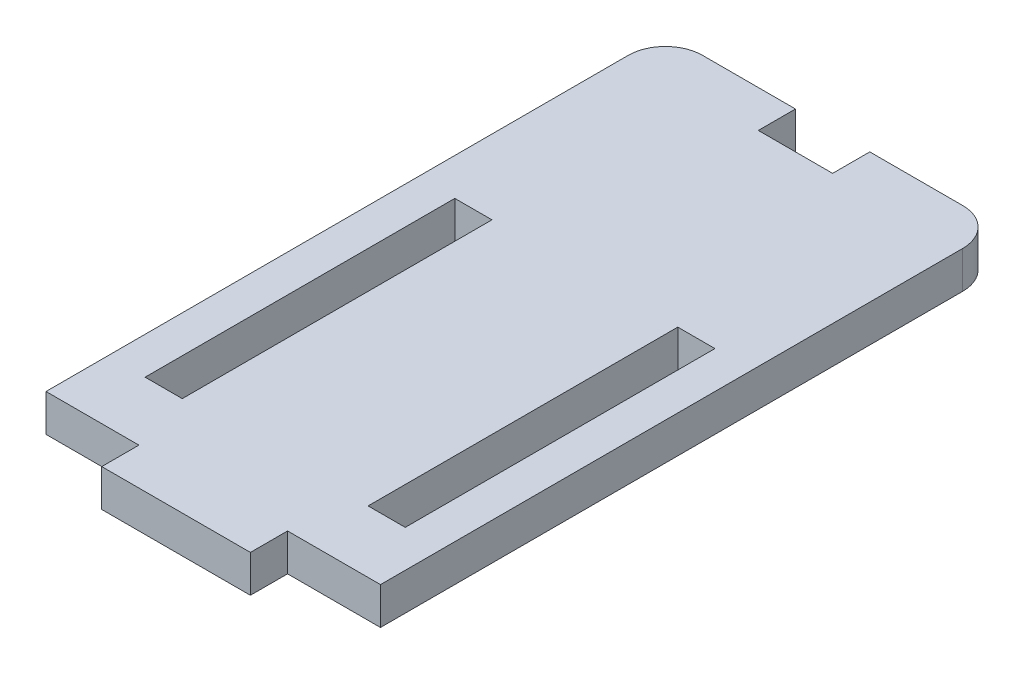
ISO-10303-21;
HEADER;
FILE_DESCRIPTION(('STEP AP214'),'2;1');
FILE_NAME('part.step','',(''),(''),'','','');
FILE_SCHEMA(('AUTOMOTIVE_DESIGN { 1 0 10303 214 1 1 1 1 }'));
ENDSEC;
DATA;
#1=APPLICATION_CONTEXT('core data for automotive mechanical design processes');
#2=APPLICATION_PROTOCOL_DEFINITION('international standard','automotive_design',2000,#1);
#3=PRODUCT_CONTEXT('',#1,'mechanical');
#4=PRODUCT('Part','Part','',(#3));
#5=PRODUCT_RELATED_PRODUCT_CATEGORY('part','',(#4));
#6=PRODUCT_DEFINITION_FORMATION('','',#4);
#7=PRODUCT_DEFINITION_CONTEXT('part definition',#1,'design');
#8=PRODUCT_DEFINITION('design','',#6,#7);
#9=PRODUCT_DEFINITION_SHAPE('','',#8);
#10=(LENGTH_UNIT() NAMED_UNIT(*) SI_UNIT(.MILLI.,.METRE.));
#11=(NAMED_UNIT(*) PLANE_ANGLE_UNIT() SI_UNIT($,.RADIAN.));
#12=(NAMED_UNIT(*) SI_UNIT($,.STERADIAN.) SOLID_ANGLE_UNIT());
#13=UNCERTAINTY_MEASURE_WITH_UNIT(LENGTH_MEASURE(1.E-05),#10,'distance_accuracy_value','');
#14=(GEOMETRIC_REPRESENTATION_CONTEXT(3) GLOBAL_UNCERTAINTY_ASSIGNED_CONTEXT((#13)) GLOBAL_UNIT_ASSIGNED_CONTEXT((#10,
#11,#12)) REPRESENTATION_CONTEXT('',''));
#15=CARTESIAN_POINT('',(0.,0.,0.));
#16=DIRECTION('',(0.,0.,1.));
#17=DIRECTION('',(1.,0.,0.));
#18=AXIS2_PLACEMENT_3D('',#15,#16,#17);
#19=CARTESIAN_POINT('',(-13.5,1.5,-25.));
#20=DIRECTION('',(0.,0.,1.));
#21=DIRECTION('',(1.,0.,0.));
#22=AXIS2_PLACEMENT_3D('',#19,#20,#21);
#23=PLANE('',#22);
#24=DIRECTION('',(-1.,0.,0.));
#25=VECTOR('',#24,1.);
#26=CARTESIAN_POINT('',(-13.5,1.5,-25.));
#27=LINE('',#26,#25);
#28=CARTESIAN_POINT('',(-3.,1.5,-25.));
#29=VERTEX_POINT('',#28);
#30=CARTESIAN_POINT('',(-10.5,1.5,-25.));
#31=VERTEX_POINT('',#30);
#32=EDGE_CURVE('E320',#29,#31,#27,.T.);
#33=ORIENTED_EDGE('',*,*,#32,.F.);
#34=DIRECTION('',(0.,1.,0.));
#35=VECTOR('',#34,1.);
#36=CARTESIAN_POINT('',(-3.,-1.5,-25.));
#37=LINE('',#36,#35);
#38=CARTESIAN_POINT('',(-3.,-1.5,-25.));
#39=VERTEX_POINT('',#38);
#40=EDGE_CURVE('E201',#39,#29,#37,.T.);
#41=ORIENTED_EDGE('',*,*,#40,.F.);
#42=DIRECTION('',(-1.,0.,0.));
#43=VECTOR('',#42,1.);
#44=CARTESIAN_POINT('',(-13.5,-1.5,-25.));
#45=LINE('',#44,#43);
#46=CARTESIAN_POINT('',(-10.5,-1.5,-25.));
#47=VERTEX_POINT('',#46);
#48=EDGE_CURVE('E332',#39,#47,#45,.T.);
#49=ORIENTED_EDGE('',*,*,#48,.T.);
#50=DIRECTION('',(0.,-1.,0.));
#51=VECTOR('',#50,1.);
#52=CARTESIAN_POINT('',(-10.5,1.5,-25.));
#53=LINE('',#52,#51);
#54=EDGE_CURVE('E340',#47,#31,#53,.F.);
#55=ORIENTED_EDGE('',*,*,#54,.T.);
#56=EDGE_LOOP('',(#33,#41,#49,#55));
#57=FACE_BOUND('',#56,.T.);
#58=ADVANCED_FACE('F36',(#57),#23,.F.);
#59=CARTESIAN_POINT('',(-13.5,1.5,25.));
#60=DIRECTION('',(0.,0.,-1.));
#61=DIRECTION('',(-1.,0.,0.));
#62=AXIS2_PLACEMENT_3D('',#59,#60,#61);
#63=PLANE('',#62);
#64=DIRECTION('',(0.,-1.,0.));
#65=VECTOR('',#64,1.);
#66=CARTESIAN_POINT('',(-6.0000000000001,1.5,25.));
#67=LINE('',#66,#65);
#68=CARTESIAN_POINT('',(-6.0000000000001,1.5,25.));
#69=VERTEX_POINT('',#68);
#70=CARTESIAN_POINT('',(-6.0000000000001,-1.5,25.));
#71=VERTEX_POINT('',#70);
#72=EDGE_CURVE('E293',#69,#71,#67,.T.);
#73=ORIENTED_EDGE('',*,*,#72,.F.);
#74=DIRECTION('',(1.,0.,0.));
#75=VECTOR('',#74,1.);
#76=CARTESIAN_POINT('',(-13.5,1.5,25.));
#77=LINE('',#76,#75);
#78=CARTESIAN_POINT('',(-13.5,1.5,25.));
#79=VERTEX_POINT('',#78);
#80=EDGE_CURVE('E314',#79,#69,#77,.T.);
#81=ORIENTED_EDGE('',*,*,#80,.F.);
#82=DIRECTION('',(0.,-1.,0.));
#83=VECTOR('',#82,1.);
#84=CARTESIAN_POINT('',(-13.5,1.5,25.));
#85=LINE('',#84,#83);
#86=CARTESIAN_POINT('',(-13.5,-1.5,25.));
#87=VERTEX_POINT('',#86);
#88=EDGE_CURVE('E337',#79,#87,#85,.T.);
#89=ORIENTED_EDGE('',*,*,#88,.T.);
#90=DIRECTION('',(1.,0.,0.));
#91=VECTOR('',#90,1.);
#92=CARTESIAN_POINT('',(-13.5,-1.5,25.));
#93=LINE('',#92,#91);
#94=EDGE_CURVE('E326',#87,#71,#93,.T.);
#95=ORIENTED_EDGE('',*,*,#94,.T.);
#96=EDGE_LOOP('',(#73,#81,#89,#95));
#97=FACE_BOUND('',#96,.T.);
#98=ADVANCED_FACE('F391',(#97),#63,.F.);
#99=CARTESIAN_POINT('',(-13.5,1.5,-25.));
#100=DIRECTION('',(1.,0.,0.));
#101=DIRECTION('',(0.,0.,-1.));
#102=AXIS2_PLACEMENT_3D('',#99,#100,#101);
#103=PLANE('',#102);
#104=DIRECTION('',(0.,0.,1.));
#105=VECTOR('',#104,1.);
#106=CARTESIAN_POINT('',(-13.5,1.5,-25.));
#107=LINE('',#106,#105);
#108=CARTESIAN_POINT('',(-13.5,1.5,-22.));
#109=VERTEX_POINT('',#108);
#110=EDGE_CURVE('E310',#109,#79,#107,.T.);
#111=ORIENTED_EDGE('',*,*,#110,.F.);
#112=DIRECTION('',(0.,-1.,0.));
#113=VECTOR('',#112,1.);
#114=CARTESIAN_POINT('',(-13.5,1.5,-22.));
#115=LINE('',#114,#113);
#116=CARTESIAN_POINT('',(-13.5,-1.5,-22.));
#117=VERTEX_POINT('',#116);
#118=EDGE_CURVE('E11',#109,#117,#115,.T.);
#119=ORIENTED_EDGE('',*,*,#118,.T.);
#120=DIRECTION('',(0.,0.,1.));
#121=VECTOR('',#120,1.);
#122=CARTESIAN_POINT('',(-13.5,-1.5,-25.));
#123=LINE('',#122,#121);
#124=EDGE_CURVE('E309',#117,#87,#123,.T.);
#125=ORIENTED_EDGE('',*,*,#124,.T.);
#126=ORIENTED_EDGE('',*,*,#88,.F.);
#127=EDGE_LOOP('',(#111,#119,#125,#126));
#128=FACE_BOUND('',#127,.T.);
#129=ADVANCED_FACE('F395',(#128),#103,.F.);
#130=CARTESIAN_POINT('',(6.0000000000001,1.5,25.));
#131=VERTEX_POINT('',#130);
#132=CARTESIAN_POINT('',(13.5,1.5,25.));
#133=VERTEX_POINT('',#132);
#134=EDGE_CURVE('E312',#131,#133,#77,.T.);
#135=ORIENTED_EDGE('',*,*,#134,.F.);
#136=DIRECTION('',(0.,-1.,0.));
#137=VECTOR('',#136,1.);
#138=CARTESIAN_POINT('',(6.0000000000001,1.5,25.));
#139=LINE('',#138,#137);
#140=CARTESIAN_POINT('',(6.0000000000001,-1.5,25.));
#141=VERTEX_POINT('',#140);
#142=EDGE_CURVE('E300',#131,#141,#139,.T.);
#143=ORIENTED_EDGE('',*,*,#142,.T.);
#144=CARTESIAN_POINT('',(13.5,-1.5,25.));
#145=VERTEX_POINT('',#144);
#146=EDGE_CURVE('E325',#141,#145,#93,.T.);
#147=ORIENTED_EDGE('',*,*,#146,.T.);
#148=DIRECTION('',(0.,-1.,0.));
#149=VECTOR('',#148,1.);
#150=CARTESIAN_POINT('',(13.5,1.5,25.));
#151=LINE('',#150,#149);
#152=EDGE_CURVE('E323',#133,#145,#151,.T.);
#153=ORIENTED_EDGE('',*,*,#152,.F.);
#154=EDGE_LOOP('',(#135,#143,#147,#153));
#155=FACE_BOUND('',#154,.T.);
#156=ADVANCED_FACE('F374',(#155),#63,.F.);
#157=CARTESIAN_POINT('',(13.5,1.5,-25.));
#158=DIRECTION('',(-1.,0.,0.));
#159=DIRECTION('',(0.,0.,1.));
#160=AXIS2_PLACEMENT_3D('',#157,#158,#159);
#161=PLANE('',#160);
#162=DIRECTION('',(0.,0.,-1.));
#163=VECTOR('',#162,1.);
#164=CARTESIAN_POINT('',(13.5,-1.5,-25.));
#165=LINE('',#164,#163);
#166=CARTESIAN_POINT('',(13.5,-1.5,-22.));
#167=VERTEX_POINT('',#166);
#168=EDGE_CURVE('E329',#145,#167,#165,.T.);
#169=ORIENTED_EDGE('',*,*,#168,.T.);
#170=DIRECTION('',(0.,-1.,0.));
#171=VECTOR('',#170,1.);
#172=CARTESIAN_POINT('',(13.5,1.5,-22.));
#173=LINE('',#172,#171);
#174=CARTESIAN_POINT('',(13.5,1.5,-22.));
#175=VERTEX_POINT('',#174);
#176=EDGE_CURVE('E351',#167,#175,#173,.F.);
#177=ORIENTED_EDGE('',*,*,#176,.T.);
#178=DIRECTION('',(0.,0.,-1.));
#179=VECTOR('',#178,1.);
#180=CARTESIAN_POINT('',(13.5,1.5,-25.));
#181=LINE('',#180,#179);
#182=EDGE_CURVE('E317',#133,#175,#181,.T.);
#183=ORIENTED_EDGE('',*,*,#182,.F.);
#184=ORIENTED_EDGE('',*,*,#152,.T.);
#185=EDGE_LOOP('',(#169,#177,#183,#184));
#186=FACE_BOUND('',#185,.T.);
#187=ADVANCED_FACE('F370',(#186),#161,.F.);
#188=CARTESIAN_POINT('',(10.5,-1.5,-25.));
#189=VERTEX_POINT('',#188);
#190=CARTESIAN_POINT('',(3.,-1.5,-25.));
#191=VERTEX_POINT('',#190);
#192=EDGE_CURVE('E313',#189,#191,#45,.T.);
#193=ORIENTED_EDGE('',*,*,#192,.T.);
#194=DIRECTION('',(0.,1.,0.));
#195=VECTOR('',#194,1.);
#196=CARTESIAN_POINT('',(3.,-1.5,-25.));
#197=LINE('',#196,#195);
#198=CARTESIAN_POINT('',(3.,1.5,-25.));
#199=VERTEX_POINT('',#198);
#200=EDGE_CURVE('E217',#191,#199,#197,.T.);
#201=ORIENTED_EDGE('',*,*,#200,.T.);
#202=CARTESIAN_POINT('',(10.5,1.5,-25.));
#203=VERTEX_POINT('',#202);
#204=EDGE_CURVE('E321',#203,#199,#27,.T.);
#205=ORIENTED_EDGE('',*,*,#204,.F.);
#206=DIRECTION('',(0.,-1.,0.));
#207=VECTOR('',#206,1.);
#208=CARTESIAN_POINT('',(10.5,1.5,-25.));
#209=LINE('',#208,#207);
#210=EDGE_CURVE('E343',#203,#189,#209,.T.);
#211=ORIENTED_EDGE('',*,*,#210,.T.);
#212=EDGE_LOOP('',(#193,#201,#205,#211));
#213=FACE_BOUND('',#212,.T.);
#214=ADVANCED_FACE('F360',(#213),#23,.F.);
#215=CARTESIAN_POINT('',(0.,1.5,0.));
#216=DIRECTION('',(0.,1.,0.));
#217=DIRECTION('',(0.,0.,1.));
#218=AXIS2_PLACEMENT_3D('',#215,#216,#217);
#219=PLANE('',#218);
#220=DIRECTION('',(0.,0.,1.));
#221=VECTOR('',#220,1.);
#222=CARTESIAN_POINT('',(-3.,1.5,-25.));
#223=LINE('',#222,#221);
#224=CARTESIAN_POINT('',(-3.,1.5,-22.));
#225=VERTEX_POINT('',#224);
#226=EDGE_CURVE('E198',#29,#225,#223,.T.);
#227=ORIENTED_EDGE('',*,*,#226,.F.);
#228=ORIENTED_EDGE('',*,*,#32,.T.);
#229=CARTESIAN_POINT('',(-10.5,1.5,-22.));
#230=DIRECTION('',(0.,1.,0.));
#231=DIRECTION('',(0.,0.,1.));
#232=AXIS2_PLACEMENT_3D('',#229,#230,#231);
#233=CIRCLE('',#232,3.);
#234=EDGE_CURVE('E59',#31,#109,#233,.T.);
#235=ORIENTED_EDGE('',*,*,#234,.T.);
#236=ORIENTED_EDGE('',*,*,#110,.T.);
#237=ORIENTED_EDGE('',*,*,#80,.T.);
#238=DIRECTION('',(0.,0.,1.));
#239=VECTOR('',#238,1.);
#240=CARTESIAN_POINT('',(-6.0000000000001,1.5,25.));
#241=LINE('',#240,#239);
#242=CARTESIAN_POINT('',(-6.0000000000001,1.5,28.));
#243=VERTEX_POINT('',#242);
#244=EDGE_CURVE('E285',#69,#243,#241,.T.);
#245=ORIENTED_EDGE('',*,*,#244,.T.);
#246=DIRECTION('',(1.,0.,0.));
#247=VECTOR('',#246,1.);
#248=CARTESIAN_POINT('',(-6.0000000000001,1.5,28.));
#249=LINE('',#248,#247);
#250=CARTESIAN_POINT('',(5.9999999999999,1.5,28.));
#251=VERTEX_POINT('',#250);
#252=EDGE_CURVE('E288',#243,#251,#249,.T.);
#253=ORIENTED_EDGE('',*,*,#252,.T.);
#254=DIRECTION('',(0.,0.,-1.));
#255=VECTOR('',#254,1.);
#256=CARTESIAN_POINT('',(6.0000000000001,1.5,25.));
#257=LINE('',#256,#255);
#258=EDGE_CURVE('E291',#251,#131,#257,.T.);
#259=ORIENTED_EDGE('',*,*,#258,.T.);
#260=ORIENTED_EDGE('',*,*,#134,.T.);
#261=ORIENTED_EDGE('',*,*,#182,.T.);
#262=CARTESIAN_POINT('',(10.5,1.5,-22.));
#263=DIRECTION('',(0.,1.,0.));
#264=DIRECTION('',(0.,0.,1.));
#265=AXIS2_PLACEMENT_3D('',#262,#263,#264);
#266=CIRCLE('',#265,3.);
#267=EDGE_CURVE('E44',#175,#203,#266,.T.);
#268=ORIENTED_EDGE('',*,*,#267,.T.);
#269=ORIENTED_EDGE('',*,*,#204,.T.);
#270=DIRECTION('',(0.,0.,-1.));
#271=VECTOR('',#270,1.);
#272=CARTESIAN_POINT('',(3.,1.5,-25.));
#273=LINE('',#272,#271);
#274=CARTESIAN_POINT('',(3.,1.5,-22.));
#275=VERTEX_POINT('',#274);
#276=EDGE_CURVE('E207',#275,#199,#273,.T.);
#277=ORIENTED_EDGE('',*,*,#276,.F.);
#278=DIRECTION('',(1.,0.,0.));
#279=VECTOR('',#278,1.);
#280=CARTESIAN_POINT('',(-3.,1.5,-22.));
#281=LINE('',#280,#279);
#282=EDGE_CURVE('E189',#225,#275,#281,.T.);
#283=ORIENTED_EDGE('',*,*,#282,.F.);
#284=EDGE_LOOP('',(#227,#228,#235,#236,#237,#245,#253,#259,#260,#261,#268,#269,#277,#283));
#285=FACE_BOUND('',#284,.T.);
#286=DIRECTION('',(0.,0.,1.));
#287=VECTOR('',#286,1.);
#288=CARTESIAN_POINT('',(-10.5,1.5,-5.));
#289=LINE('',#288,#287);
#290=CARTESIAN_POINT('',(-10.5,1.5,-5.));
#291=VERTEX_POINT('',#290);
#292=CARTESIAN_POINT('',(-10.5,1.5,20.));
#293=VERTEX_POINT('',#292);
#294=EDGE_CURVE('E221',#291,#293,#289,.T.);
#295=ORIENTED_EDGE('',*,*,#294,.F.);
#296=DIRECTION('',(-1.,0.,0.));
#297=VECTOR('',#296,1.);
#298=CARTESIAN_POINT('',(-10.5,1.5,-5.));
#299=LINE('',#298,#297);
#300=CARTESIAN_POINT('',(-7.5,1.5,-5.));
#301=VERTEX_POINT('',#300);
#302=EDGE_CURVE('E230',#301,#291,#299,.T.);
#303=ORIENTED_EDGE('',*,*,#302,.F.);
#304=DIRECTION('',(0.,0.,-1.));
#305=VECTOR('',#304,1.);
#306=CARTESIAN_POINT('',(-7.5,1.5,-5.));
#307=LINE('',#306,#305);
#308=CARTESIAN_POINT('',(-7.5,1.5,20.));
#309=VERTEX_POINT('',#308);
#310=EDGE_CURVE('E227',#309,#301,#307,.T.);
#311=ORIENTED_EDGE('',*,*,#310,.F.);
#312=DIRECTION('',(1.,0.,0.));
#313=VECTOR('',#312,1.);
#314=CARTESIAN_POINT('',(-10.5,1.5,20.));
#315=LINE('',#314,#313);
#316=EDGE_CURVE('E223',#293,#309,#315,.T.);
#317=ORIENTED_EDGE('',*,*,#316,.F.);
#318=EDGE_LOOP('',(#295,#303,#311,#317));
#319=FACE_BOUND('',#318,.T.);
#320=DIRECTION('',(-1.,0.,0.));
#321=VECTOR('',#320,1.);
#322=CARTESIAN_POINT('',(10.5,1.5,-5.));
#323=LINE('',#322,#321);
#324=CARTESIAN_POINT('',(10.5,1.5,-5.));
#325=VERTEX_POINT('',#324);
#326=CARTESIAN_POINT('',(7.5,1.5,-5.));
#327=VERTEX_POINT('',#326);
#328=EDGE_CURVE('E216',#325,#327,#323,.T.);
#329=ORIENTED_EDGE('',*,*,#328,.F.);
#330=DIRECTION('',(0.,0.,-1.));
#331=VECTOR('',#330,1.);
#332=CARTESIAN_POINT('',(10.5,1.5,-5.));
#333=LINE('',#332,#331);
#334=CARTESIAN_POINT('',(10.5,1.5,20.));
#335=VERTEX_POINT('',#334);
#336=EDGE_CURVE('E262',#335,#325,#333,.T.);
#337=ORIENTED_EDGE('',*,*,#336,.F.);
#338=DIRECTION('',(1.,0.,0.));
#339=VECTOR('',#338,1.);
#340=CARTESIAN_POINT('',(10.5,1.5,20.));
#341=LINE('',#340,#339);
#342=CARTESIAN_POINT('',(7.5,1.5,20.));
#343=VERTEX_POINT('',#342);
#344=EDGE_CURVE('E259',#343,#335,#341,.T.);
#345=ORIENTED_EDGE('',*,*,#344,.F.);
#346=DIRECTION('',(0.,0.,1.));
#347=VECTOR('',#346,1.);
#348=CARTESIAN_POINT('',(7.5,1.5,-5.));
#349=LINE('',#348,#347);
#350=EDGE_CURVE('E256',#327,#343,#349,.T.);
#351=ORIENTED_EDGE('',*,*,#350,.F.);
#352=EDGE_LOOP('',(#329,#337,#345,#351));
#353=FACE_BOUND('',#352,.T.);
#354=ADVANCED_FACE('F204',(#285,#319,#353),#219,.T.);
#355=CARTESIAN_POINT('',(0.,-1.5,0.));
#356=DIRECTION('',(0.,1.,0.));
#357=DIRECTION('',(0.,0.,1.));
#358=AXIS2_PLACEMENT_3D('',#355,#356,#357);
#359=PLANE('',#358);
#360=ORIENTED_EDGE('',*,*,#48,.F.);
#361=DIRECTION('',(0.,0.,1.));
#362=VECTOR('',#361,1.);
#363=CARTESIAN_POINT('',(-3.,-1.5,-25.));
#364=LINE('',#363,#362);
#365=CARTESIAN_POINT('',(-3.,-1.5,-22.));
#366=VERTEX_POINT('',#365);
#367=EDGE_CURVE('E209',#39,#366,#364,.T.);
#368=ORIENTED_EDGE('',*,*,#367,.T.);
#369=DIRECTION('',(1.,0.,0.));
#370=VECTOR('',#369,1.);
#371=CARTESIAN_POINT('',(-3.,-1.5,-22.));
#372=LINE('',#371,#370);
#373=CARTESIAN_POINT('',(3.,-1.5,-22.));
#374=VERTEX_POINT('',#373);
#375=EDGE_CURVE('E192',#366,#374,#372,.T.);
#376=ORIENTED_EDGE('',*,*,#375,.T.);
#377=DIRECTION('',(0.,0.,-1.));
#378=VECTOR('',#377,1.);
#379=CARTESIAN_POINT('',(3.,-1.5,-25.));
#380=LINE('',#379,#378);
#381=EDGE_CURVE('E51',#374,#191,#380,.T.);
#382=ORIENTED_EDGE('',*,*,#381,.T.);
#383=ORIENTED_EDGE('',*,*,#192,.F.);
#384=CARTESIAN_POINT('',(10.5,-1.5,-22.));
#385=DIRECTION('',(0.,1.,0.));
#386=DIRECTION('',(0.,0.,1.));
#387=AXIS2_PLACEMENT_3D('',#384,#385,#386);
#388=CIRCLE('',#387,3.);
#389=EDGE_CURVE('E349',#189,#167,#388,.F.);
#390=ORIENTED_EDGE('',*,*,#389,.T.);
#391=ORIENTED_EDGE('',*,*,#168,.F.);
#392=ORIENTED_EDGE('',*,*,#146,.F.);
#393=DIRECTION('',(0.,0.,-1.));
#394=VECTOR('',#393,1.);
#395=CARTESIAN_POINT('',(6.0000000000001,-1.5,25.));
#396=LINE('',#395,#394);
#397=CARTESIAN_POINT('',(5.9999999999999,-1.5,28.));
#398=VERTEX_POINT('',#397);
#399=EDGE_CURVE('E289',#398,#141,#396,.T.);
#400=ORIENTED_EDGE('',*,*,#399,.F.);
#401=DIRECTION('',(1.,0.,0.));
#402=VECTOR('',#401,1.);
#403=CARTESIAN_POINT('',(-6.0000000000001,-1.5,28.));
#404=LINE('',#403,#402);
#405=CARTESIAN_POINT('',(-6.0000000000001,-1.5,28.));
#406=VERTEX_POINT('',#405);
#407=EDGE_CURVE('E296',#406,#398,#404,.T.);
#408=ORIENTED_EDGE('',*,*,#407,.F.);
#409=DIRECTION('',(0.,0.,1.));
#410=VECTOR('',#409,1.);
#411=CARTESIAN_POINT('',(-6.0000000000001,-1.5,25.));
#412=LINE('',#411,#410);
#413=EDGE_CURVE('E248',#71,#406,#412,.T.);
#414=ORIENTED_EDGE('',*,*,#413,.F.);
#415=ORIENTED_EDGE('',*,*,#94,.F.);
#416=ORIENTED_EDGE('',*,*,#124,.F.);
#417=CARTESIAN_POINT('',(-10.5,-1.5,-22.));
#418=DIRECTION('',(0.,1.,0.));
#419=DIRECTION('',(0.,0.,1.));
#420=AXIS2_PLACEMENT_3D('',#417,#418,#419);
#421=CIRCLE('',#420,3.);
#422=EDGE_CURVE('E346',#117,#47,#421,.F.);
#423=ORIENTED_EDGE('',*,*,#422,.T.);
#424=EDGE_LOOP('',(#360,#368,#376,#382,#383,#390,#391,#392,#400,#408,#414,#415,#416,#423));
#425=FACE_BOUND('',#424,.T.);
#426=DIRECTION('',(-1.,0.,0.));
#427=VECTOR('',#426,1.);
#428=CARTESIAN_POINT('',(-10.5,-1.5,-5.));
#429=LINE('',#428,#427);
#430=CARTESIAN_POINT('',(-7.5,-1.5,-5.));
#431=VERTEX_POINT('',#430);
#432=CARTESIAN_POINT('',(-10.5,-1.5,-5.));
#433=VERTEX_POINT('',#432);
#434=EDGE_CURVE('E242',#431,#433,#429,.T.);
#435=ORIENTED_EDGE('',*,*,#434,.T.);
#436=DIRECTION('',(0.,0.,1.));
#437=VECTOR('',#436,1.);
#438=CARTESIAN_POINT('',(-10.5,-1.5,-5.));
#439=LINE('',#438,#437);
#440=CARTESIAN_POINT('',(-10.5,-1.5,20.));
#441=VERTEX_POINT('',#440);
#442=EDGE_CURVE('E233',#433,#441,#439,.T.);
#443=ORIENTED_EDGE('',*,*,#442,.T.);
#444=DIRECTION('',(1.,0.,0.));
#445=VECTOR('',#444,1.);
#446=CARTESIAN_POINT('',(-10.5,-1.5,20.));
#447=LINE('',#446,#445);
#448=CARTESIAN_POINT('',(-7.5,-1.5,20.));
#449=VERTEX_POINT('',#448);
#450=EDGE_CURVE('E236',#441,#449,#447,.T.);
#451=ORIENTED_EDGE('',*,*,#450,.T.);
#452=DIRECTION('',(0.,0.,-1.));
#453=VECTOR('',#452,1.);
#454=CARTESIAN_POINT('',(-7.5,-1.5,-5.));
#455=LINE('',#454,#453);
#456=EDGE_CURVE('E239',#449,#431,#455,.T.);
#457=ORIENTED_EDGE('',*,*,#456,.T.);
#458=EDGE_LOOP('',(#435,#443,#451,#457));
#459=FACE_BOUND('',#458,.T.);
#460=DIRECTION('',(0.,0.,-1.));
#461=VECTOR('',#460,1.);
#462=CARTESIAN_POINT('',(10.5,-1.5,-5.));
#463=LINE('',#462,#461);
#464=CARTESIAN_POINT('',(10.5,-1.5,20.));
#465=VERTEX_POINT('',#464);
#466=CARTESIAN_POINT('',(10.5,-1.5,-5.));
#467=VERTEX_POINT('',#466);
#468=EDGE_CURVE('E274',#465,#467,#463,.T.);
#469=ORIENTED_EDGE('',*,*,#468,.T.);
#470=DIRECTION('',(-1.,0.,0.));
#471=VECTOR('',#470,1.);
#472=CARTESIAN_POINT('',(10.5,-1.5,-5.));
#473=LINE('',#472,#471);
#474=CARTESIAN_POINT('',(7.5,-1.5,-5.));
#475=VERTEX_POINT('',#474);
#476=EDGE_CURVE('E265',#467,#475,#473,.T.);
#477=ORIENTED_EDGE('',*,*,#476,.T.);
#478=DIRECTION('',(0.,0.,1.));
#479=VECTOR('',#478,1.);
#480=CARTESIAN_POINT('',(7.5,-1.5,-5.));
#481=LINE('',#480,#479);
#482=CARTESIAN_POINT('',(7.5,-1.5,20.));
#483=VERTEX_POINT('',#482);
#484=EDGE_CURVE('E268',#475,#483,#481,.T.);
#485=ORIENTED_EDGE('',*,*,#484,.T.);
#486=DIRECTION('',(1.,0.,0.));
#487=VECTOR('',#486,1.);
#488=CARTESIAN_POINT('',(10.5,-1.5,20.));
#489=LINE('',#488,#487);
#490=EDGE_CURVE('E271',#483,#465,#489,.T.);
#491=ORIENTED_EDGE('',*,*,#490,.T.);
#492=EDGE_LOOP('',(#469,#477,#485,#491));
#493=FACE_BOUND('',#492,.T.);
#494=ADVANCED_FACE('F366',(#425,#459,#493),#359,.F.);
#495=CARTESIAN_POINT('',(-6.0000000000001,1.5,25.));
#496=DIRECTION('',(1.,0.,0.));
#497=DIRECTION('',(0.,0.,-1.));
#498=AXIS2_PLACEMENT_3D('',#495,#496,#497);
#499=PLANE('',#498);
#500=ORIENTED_EDGE('',*,*,#413,.T.);
#501=DIRECTION('',(0.,-1.,0.));
#502=VECTOR('',#501,1.);
#503=CARTESIAN_POINT('',(-6.0000000000001,1.5,28.));
#504=LINE('',#503,#502);
#505=EDGE_CURVE('E306',#243,#406,#504,.T.);
#506=ORIENTED_EDGE('',*,*,#505,.F.);
#507=ORIENTED_EDGE('',*,*,#244,.F.);
#508=ORIENTED_EDGE('',*,*,#72,.T.);
#509=EDGE_LOOP('',(#500,#506,#507,#508));
#510=FACE_BOUND('',#509,.T.);
#511=ADVANCED_FACE('F386',(#510),#499,.F.);
#512=CARTESIAN_POINT('',(-6.0000000000001,1.5,28.));
#513=DIRECTION('',(0.,0.,-1.));
#514=DIRECTION('',(-1.,0.,0.));
#515=AXIS2_PLACEMENT_3D('',#512,#513,#514);
#516=PLANE('',#515);
#517=ORIENTED_EDGE('',*,*,#407,.T.);
#518=DIRECTION('',(0.,-1.,0.));
#519=VECTOR('',#518,1.);
#520=CARTESIAN_POINT('',(5.9999999999999,1.5,28.));
#521=LINE('',#520,#519);
#522=EDGE_CURVE('E303',#251,#398,#521,.T.);
#523=ORIENTED_EDGE('',*,*,#522,.F.);
#524=ORIENTED_EDGE('',*,*,#252,.F.);
#525=ORIENTED_EDGE('',*,*,#505,.T.);
#526=EDGE_LOOP('',(#517,#523,#524,#525));
#527=FACE_BOUND('',#526,.T.);
#528=ADVANCED_FACE('F383',(#527),#516,.F.);
#529=CARTESIAN_POINT('',(6.0000000000001,1.5,25.));
#530=DIRECTION('',(-1.,0.,0.));
#531=DIRECTION('',(0.,0.,1.));
#532=AXIS2_PLACEMENT_3D('',#529,#530,#531);
#533=PLANE('',#532);
#534=ORIENTED_EDGE('',*,*,#399,.T.);
#535=ORIENTED_EDGE('',*,*,#142,.F.);
#536=ORIENTED_EDGE('',*,*,#258,.F.);
#537=ORIENTED_EDGE('',*,*,#522,.T.);
#538=EDGE_LOOP('',(#534,#535,#536,#537));
#539=FACE_BOUND('',#538,.T.);
#540=ADVANCED_FACE('F379',(#539),#533,.F.);
#541=CARTESIAN_POINT('',(10.5,-1.5,-5.));
#542=DIRECTION('',(0.,0.,-1.));
#543=DIRECTION('',(-1.,0.,0.));
#544=AXIS2_PLACEMENT_3D('',#541,#542,#543);
#545=PLANE('',#544);
#546=DIRECTION('',(0.,1.,0.));
#547=VECTOR('',#546,1.);
#548=CARTESIAN_POINT('',(7.5,-1.5,-5.));
#549=LINE('',#548,#547);
#550=EDGE_CURVE('E277',#475,#327,#549,.T.);
#551=ORIENTED_EDGE('',*,*,#550,.F.);
#552=ORIENTED_EDGE('',*,*,#476,.F.);
#553=DIRECTION('',(0.,1.,0.));
#554=VECTOR('',#553,1.);
#555=CARTESIAN_POINT('',(10.5,-1.5,-5.));
#556=LINE('',#555,#554);
#557=EDGE_CURVE('E224',#467,#325,#556,.T.);
#558=ORIENTED_EDGE('',*,*,#557,.T.);
#559=ORIENTED_EDGE('',*,*,#328,.T.);
#560=EDGE_LOOP('',(#551,#552,#558,#559));
#561=FACE_BOUND('',#560,.T.);
#562=ADVANCED_FACE('F446',(#561),#545,.F.);
#563=CARTESIAN_POINT('',(10.5,-1.5,-5.));
#564=DIRECTION('',(1.,0.,0.));
#565=DIRECTION('',(0.,0.,-1.));
#566=AXIS2_PLACEMENT_3D('',#563,#564,#565);
#567=PLANE('',#566);
#568=ORIENTED_EDGE('',*,*,#557,.F.);
#569=ORIENTED_EDGE('',*,*,#468,.F.);
#570=DIRECTION('',(0.,1.,0.));
#571=VECTOR('',#570,1.);
#572=CARTESIAN_POINT('',(10.5,-1.5,20.));
#573=LINE('',#572,#571);
#574=EDGE_CURVE('E279',#465,#335,#573,.T.);
#575=ORIENTED_EDGE('',*,*,#574,.T.);
#576=ORIENTED_EDGE('',*,*,#336,.T.);
#577=EDGE_LOOP('',(#568,#569,#575,#576));
#578=FACE_BOUND('',#577,.T.);
#579=ADVANCED_FACE('F442',(#578),#567,.F.);
#580=CARTESIAN_POINT('',(10.5,-1.5,20.));
#581=DIRECTION('',(0.,0.,1.));
#582=DIRECTION('',(1.,0.,0.));
#583=AXIS2_PLACEMENT_3D('',#580,#581,#582);
#584=PLANE('',#583);
#585=ORIENTED_EDGE('',*,*,#574,.F.);
#586=ORIENTED_EDGE('',*,*,#490,.F.);
#587=DIRECTION('',(0.,1.,0.));
#588=VECTOR('',#587,1.);
#589=CARTESIAN_POINT('',(7.5,-1.5,20.));
#590=LINE('',#589,#588);
#591=EDGE_CURVE('E281',#483,#343,#590,.T.);
#592=ORIENTED_EDGE('',*,*,#591,.T.);
#593=ORIENTED_EDGE('',*,*,#344,.T.);
#594=EDGE_LOOP('',(#585,#586,#592,#593));
#595=FACE_BOUND('',#594,.T.);
#596=ADVANCED_FACE('F445',(#595),#584,.F.);
#597=CARTESIAN_POINT('',(7.5,-1.5,-5.));
#598=DIRECTION('',(-1.,0.,0.));
#599=DIRECTION('',(0.,0.,1.));
#600=AXIS2_PLACEMENT_3D('',#597,#598,#599);
#601=PLANE('',#600);
#602=ORIENTED_EDGE('',*,*,#591,.F.);
#603=ORIENTED_EDGE('',*,*,#484,.F.);
#604=ORIENTED_EDGE('',*,*,#550,.T.);
#605=ORIENTED_EDGE('',*,*,#350,.T.);
#606=EDGE_LOOP('',(#602,#603,#604,#605));
#607=FACE_BOUND('',#606,.T.);
#608=ADVANCED_FACE('F440',(#607),#601,.F.);
#609=CARTESIAN_POINT('',(-10.5,-1.5,-5.));
#610=DIRECTION('',(-1.,0.,0.));
#611=DIRECTION('',(0.,0.,1.));
#612=AXIS2_PLACEMENT_3D('',#609,#610,#611);
#613=PLANE('',#612);
#614=DIRECTION('',(0.,1.,0.));
#615=VECTOR('',#614,1.);
#616=CARTESIAN_POINT('',(-10.5,-1.5,20.));
#617=LINE('',#616,#615);
#618=EDGE_CURVE('E245',#441,#293,#617,.T.);
#619=ORIENTED_EDGE('',*,*,#618,.F.);
#620=ORIENTED_EDGE('',*,*,#442,.F.);
#621=DIRECTION('',(0.,1.,0.));
#622=VECTOR('',#621,1.);
#623=CARTESIAN_POINT('',(-10.5,-1.5,-5.));
#624=LINE('',#623,#622);
#625=EDGE_CURVE('E246',#433,#291,#624,.T.);
#626=ORIENTED_EDGE('',*,*,#625,.T.);
#627=ORIENTED_EDGE('',*,*,#294,.T.);
#628=EDGE_LOOP('',(#619,#620,#626,#627));
#629=FACE_BOUND('',#628,.T.);
#630=ADVANCED_FACE('F437',(#629),#613,.F.);
#631=CARTESIAN_POINT('',(-10.5,-1.5,-5.));
#632=DIRECTION('',(0.,0.,-1.));
#633=DIRECTION('',(-1.,0.,0.));
#634=AXIS2_PLACEMENT_3D('',#631,#632,#633);
#635=PLANE('',#634);
#636=ORIENTED_EDGE('',*,*,#625,.F.);
#637=ORIENTED_EDGE('',*,*,#434,.F.);
#638=DIRECTION('',(0.,1.,0.));
#639=VECTOR('',#638,1.);
#640=CARTESIAN_POINT('',(-7.5,-1.5,-5.));
#641=LINE('',#640,#639);
#642=EDGE_CURVE('E249',#431,#301,#641,.T.);
#643=ORIENTED_EDGE('',*,*,#642,.T.);
#644=ORIENTED_EDGE('',*,*,#302,.T.);
#645=EDGE_LOOP('',(#636,#637,#643,#644));
#646=FACE_BOUND('',#645,.T.);
#647=ADVANCED_FACE('F431',(#646),#635,.F.);
#648=CARTESIAN_POINT('',(-7.5,-1.5,-5.));
#649=DIRECTION('',(1.,0.,0.));
#650=DIRECTION('',(0.,0.,-1.));
#651=AXIS2_PLACEMENT_3D('',#648,#649,#650);
#652=PLANE('',#651);
#653=ORIENTED_EDGE('',*,*,#642,.F.);
#654=ORIENTED_EDGE('',*,*,#456,.F.);
#655=DIRECTION('',(0.,1.,0.));
#656=VECTOR('',#655,1.);
#657=CARTESIAN_POINT('',(-7.5,-1.5,20.));
#658=LINE('',#657,#656);
#659=EDGE_CURVE('E251',#449,#309,#658,.T.);
#660=ORIENTED_EDGE('',*,*,#659,.T.);
#661=ORIENTED_EDGE('',*,*,#310,.T.);
#662=EDGE_LOOP('',(#653,#654,#660,#661));
#663=FACE_BOUND('',#662,.T.);
#664=ADVANCED_FACE('F425',(#663),#652,.F.);
#665=CARTESIAN_POINT('',(-10.5,-1.5,20.));
#666=DIRECTION('',(0.,0.,1.));
#667=DIRECTION('',(1.,0.,0.));
#668=AXIS2_PLACEMENT_3D('',#665,#666,#667);
#669=PLANE('',#668);
#670=ORIENTED_EDGE('',*,*,#659,.F.);
#671=ORIENTED_EDGE('',*,*,#450,.F.);
#672=ORIENTED_EDGE('',*,*,#618,.T.);
#673=ORIENTED_EDGE('',*,*,#316,.T.);
#674=EDGE_LOOP('',(#670,#671,#672,#673));
#675=FACE_BOUND('',#674,.T.);
#676=ADVANCED_FACE('F420',(#675),#669,.F.);
#677=CARTESIAN_POINT('',(10.5,1.5,-22.));
#678=DIRECTION('',(0.,-1.,0.));
#679=DIRECTION('',(0.,0.,-1.));
#680=AXIS2_PLACEMENT_3D('',#677,#678,#679);
#681=CYLINDRICAL_SURFACE('',#680,3.);
#682=ORIENTED_EDGE('',*,*,#267,.F.);
#683=ORIENTED_EDGE('',*,*,#176,.F.);
#684=ORIENTED_EDGE('',*,*,#389,.F.);
#685=ORIENTED_EDGE('',*,*,#210,.F.);
#686=EDGE_LOOP('',(#682,#683,#684,#685));
#687=FACE_BOUND('',#686,.T.);
#688=ADVANCED_FACE('F362',(#687),#681,.T.);
#689=CARTESIAN_POINT('',(-10.5,1.5,-22.));
#690=DIRECTION('',(0.,-1.,0.));
#691=DIRECTION('',(0.,0.,-1.));
#692=AXIS2_PLACEMENT_3D('',#689,#690,#691);
#693=CYLINDRICAL_SURFACE('',#692,3.);
#694=ORIENTED_EDGE('',*,*,#234,.F.);
#695=ORIENTED_EDGE('',*,*,#54,.F.);
#696=ORIENTED_EDGE('',*,*,#422,.F.);
#697=ORIENTED_EDGE('',*,*,#118,.F.);
#698=EDGE_LOOP('',(#694,#695,#696,#697));
#699=FACE_BOUND('',#698,.T.);
#700=ADVANCED_FACE('F38',(#699),#693,.T.);
#701=CARTESIAN_POINT('',(-3.,-1.5,-25.));
#702=DIRECTION('',(-1.,0.,0.));
#703=DIRECTION('',(0.,0.,1.));
#704=AXIS2_PLACEMENT_3D('',#701,#702,#703);
#705=PLANE('',#704);
#706=DIRECTION('',(0.,1.,0.));
#707=VECTOR('',#706,1.);
#708=CARTESIAN_POINT('',(-3.,-1.5,-22.));
#709=LINE('',#708,#707);
#710=EDGE_CURVE('E185',#366,#225,#709,.T.);
#711=ORIENTED_EDGE('',*,*,#710,.F.);
#712=ORIENTED_EDGE('',*,*,#367,.F.);
#713=ORIENTED_EDGE('',*,*,#40,.T.);
#714=ORIENTED_EDGE('',*,*,#226,.T.);
#715=EDGE_LOOP('',(#711,#712,#713,#714));
#716=FACE_BOUND('',#715,.T.);
#717=ADVANCED_FACE('F199',(#716),#705,.F.);
#718=CARTESIAN_POINT('',(3.,-1.5,-25.));
#719=DIRECTION('',(1.,0.,0.));
#720=DIRECTION('',(0.,0.,-1.));
#721=AXIS2_PLACEMENT_3D('',#718,#719,#720);
#722=PLANE('',#721);
#723=ORIENTED_EDGE('',*,*,#200,.F.);
#724=ORIENTED_EDGE('',*,*,#381,.F.);
#725=DIRECTION('',(0.,1.,0.));
#726=VECTOR('',#725,1.);
#727=CARTESIAN_POINT('',(3.,-1.5,-22.));
#728=LINE('',#727,#726);
#729=EDGE_CURVE('E195',#374,#275,#728,.T.);
#730=ORIENTED_EDGE('',*,*,#729,.T.);
#731=ORIENTED_EDGE('',*,*,#276,.T.);
#732=EDGE_LOOP('',(#723,#724,#730,#731));
#733=FACE_BOUND('',#732,.T.);
#734=ADVANCED_FACE('F593',(#733),#722,.F.);
#735=CARTESIAN_POINT('',(-3.,-1.5,-22.));
#736=DIRECTION('',(0.,0.,1.));
#737=DIRECTION('',(1.,0.,0.));
#738=AXIS2_PLACEMENT_3D('',#735,#736,#737);
#739=PLANE('',#738);
#740=ORIENTED_EDGE('',*,*,#729,.F.);
#741=ORIENTED_EDGE('',*,*,#375,.F.);
#742=ORIENTED_EDGE('',*,*,#710,.T.);
#743=ORIENTED_EDGE('',*,*,#282,.T.);
#744=EDGE_LOOP('',(#740,#741,#742,#743));
#745=FACE_BOUND('',#744,.T.);
#746=ADVANCED_FACE('F187',(#745),#739,.F.);
#747=CLOSED_SHELL('',(#58,#98,#129,#156,#187,#214,#354,#494,#511,#528,#540,#562,#579,#596,#608,
#630,#647,#664,#676,#688,#700,#717,#734,#746));
#748=MANIFOLD_SOLID_BREP('B2',#747);
#749=ADVANCED_BREP_SHAPE_REPRESENTATION('',(#18,#748),#14);
#750=SHAPE_DEFINITION_REPRESENTATION(#9,#749);
ENDSEC;
END-ISO-10303-21;
